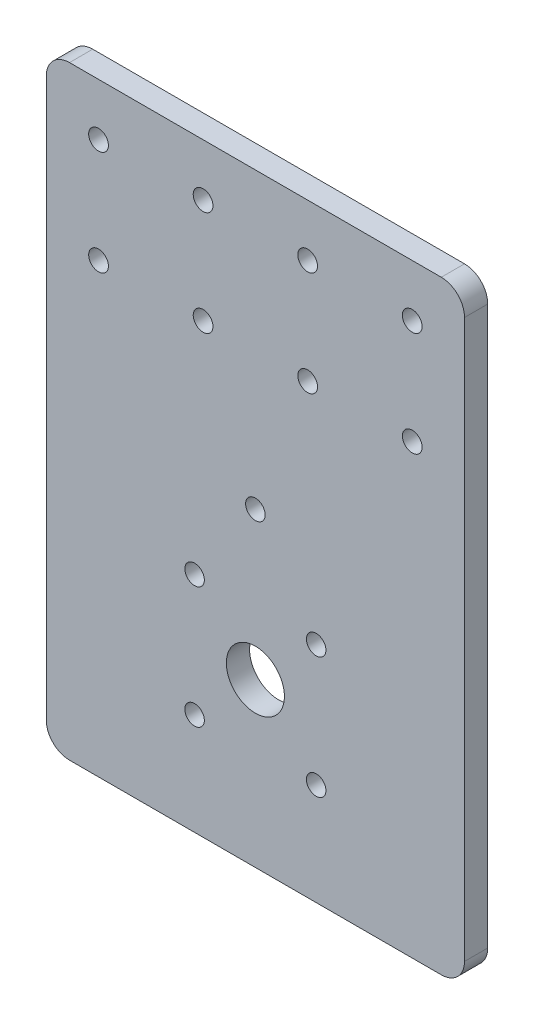
ISO-10303-21;
HEADER;
FILE_DESCRIPTION(('STEP AP214'),'2;1');
FILE_NAME('part.step','',(''),(''),'','','');
FILE_SCHEMA(('AUTOMOTIVE_DESIGN { 1 0 10303 214 1 1 1 1 }'));
ENDSEC;
DATA;
#1=APPLICATION_CONTEXT('core data for automotive mechanical design processes');
#2=APPLICATION_PROTOCOL_DEFINITION('international standard','automotive_design',2000,#1);
#3=PRODUCT_CONTEXT('',#1,'mechanical');
#4=PRODUCT('Part','Part','',(#3));
#5=PRODUCT_RELATED_PRODUCT_CATEGORY('part','',(#4));
#6=PRODUCT_DEFINITION_FORMATION('','',#4);
#7=PRODUCT_DEFINITION_CONTEXT('part definition',#1,'design');
#8=PRODUCT_DEFINITION('design','',#6,#7);
#9=PRODUCT_DEFINITION_SHAPE('','',#8);
#10=(LENGTH_UNIT() NAMED_UNIT(*) SI_UNIT(.MILLI.,.METRE.));
#11=(NAMED_UNIT(*) PLANE_ANGLE_UNIT() SI_UNIT($,.RADIAN.));
#12=(NAMED_UNIT(*) SI_UNIT($,.STERADIAN.) SOLID_ANGLE_UNIT());
#13=UNCERTAINTY_MEASURE_WITH_UNIT(LENGTH_MEASURE(1.E-05),#10,'distance_accuracy_value','');
#14=(GEOMETRIC_REPRESENTATION_CONTEXT(3) GLOBAL_UNCERTAINTY_ASSIGNED_CONTEXT((#13)) GLOBAL_UNIT_ASSIGNED_CONTEXT((#10,
#11,#12)) REPRESENTATION_CONTEXT('',''));
#15=CARTESIAN_POINT('',(0.,0.,0.));
#16=DIRECTION('',(0.,0.,1.));
#17=DIRECTION('',(1.,0.,0.));
#18=AXIS2_PLACEMENT_3D('',#15,#16,#17);
#19=CARTESIAN_POINT('',(80.,-60.,10.));
#20=DIRECTION('',(0.,0.,-1.));
#21=DIRECTION('',(-1.,0.,0.));
#22=AXIS2_PLACEMENT_3D('',#19,#20,#21);
#23=PLANE('',#22);
#24=CARTESIAN_POINT('',(80.,-60.,10.));
#25=DIRECTION('',(0.,0.,1.));
#26=DIRECTION('',(-1.,0.,0.));
#27=AXIS2_PLACEMENT_3D('',#24,#25,#26);
#28=CIRCLE('',#27,9.99999999999999);
#29=CARTESIAN_POINT('',(79.9999999999999,-70.,10.));
#30=VERTEX_POINT('',#29);
#31=CARTESIAN_POINT('',(90.,-59.9999999999999,10.));
#32=VERTEX_POINT('',#31);
#33=EDGE_CURVE('E151',#30,#32,#28,.T.);
#34=ORIENTED_EDGE('',*,*,#33,.T.);
#35=DIRECTION('',(0.,1.,0.));
#36=VECTOR('',#35,1.);
#37=CARTESIAN_POINT('',(90.,-59.9999999999999,10.));
#38=LINE('',#37,#36);
#39=CARTESIAN_POINT('',(90.,180.,10.));
#40=VERTEX_POINT('',#39);
#41=EDGE_CURVE('E99',#32,#40,#38,.T.);
#42=ORIENTED_EDGE('',*,*,#41,.T.);
#43=CARTESIAN_POINT('',(80.,180.,10.));
#44=DIRECTION('',(0.,0.,1.));
#45=DIRECTION('',(-1.,0.,0.));
#46=AXIS2_PLACEMENT_3D('',#43,#44,#45);
#47=CIRCLE('',#46,10.);
#48=CARTESIAN_POINT('',(80.,190.,10.));
#49=VERTEX_POINT('',#48);
#50=EDGE_CURVE('E166',#40,#49,#47,.T.);
#51=ORIENTED_EDGE('',*,*,#50,.T.);
#52=DIRECTION('',(-1.,0.,0.));
#53=VECTOR('',#52,1.);
#54=CARTESIAN_POINT('',(80.,190.,10.));
#55=LINE('',#54,#53);
#56=CARTESIAN_POINT('',(-79.9999999999999,190.,10.));
#57=VERTEX_POINT('',#56);
#58=EDGE_CURVE('E179',#49,#57,#55,.T.);
#59=ORIENTED_EDGE('',*,*,#58,.T.);
#60=CARTESIAN_POINT('',(-80.,180.,10.));
#61=DIRECTION('',(0.,0.,1.));
#62=DIRECTION('',(-1.,0.,0.));
#63=AXIS2_PLACEMENT_3D('',#60,#61,#62);
#64=CIRCLE('',#63,10.);
#65=CARTESIAN_POINT('',(-90.,180.,10.));
#66=VERTEX_POINT('',#65);
#67=EDGE_CURVE('E118',#57,#66,#64,.T.);
#68=ORIENTED_EDGE('',*,*,#67,.T.);
#69=DIRECTION('',(0.,-1.,0.));
#70=VECTOR('',#69,1.);
#71=CARTESIAN_POINT('',(-90.,180.,10.));
#72=LINE('',#71,#70);
#73=CARTESIAN_POINT('',(-90.,-59.9999999999999,10.));
#74=VERTEX_POINT('',#73);
#75=EDGE_CURVE('E112',#66,#74,#72,.T.);
#76=ORIENTED_EDGE('',*,*,#75,.T.);
#77=CARTESIAN_POINT('',(-80.,-60.,10.));
#78=DIRECTION('',(0.,0.,1.));
#79=DIRECTION('',(-1.,0.,0.));
#80=AXIS2_PLACEMENT_3D('',#77,#78,#79);
#81=CIRCLE('',#80,10.);
#82=CARTESIAN_POINT('',(-79.9999999999999,-70.,10.));
#83=VERTEX_POINT('',#82);
#84=EDGE_CURVE('E116',#74,#83,#81,.T.);
#85=ORIENTED_EDGE('',*,*,#84,.T.);
#86=DIRECTION('',(1.,0.,0.));
#87=VECTOR('',#86,1.);
#88=CARTESIAN_POINT('',(-79.9999999999999,-70.,10.));
#89=LINE('',#88,#87);
#90=EDGE_CURVE('E56',#83,#30,#89,.T.);
#91=ORIENTED_EDGE('',*,*,#90,.T.);
#92=EDGE_LOOP('',(#34,#42,#51,#59,#68,#76,#85,#91));
#93=FACE_BOUND('',#92,.T.);
#94=CARTESIAN_POINT('',(26.1629509039022,26.1629509039023,10.));
#95=DIRECTION('',(0.,0.,1.));
#96=DIRECTION('',(1.,0.,0.));
#97=AXIS2_PLACEMENT_3D('',#94,#95,#96);
#98=CIRCLE('',#97,4.20000000000001);
#99=CARTESIAN_POINT('',(30.3629509039022,26.1629509039023,10.));
#100=VERTEX_POINT('',#99);
#101=EDGE_CURVE('E140',#100,#100,#98,.T.);
#102=ORIENTED_EDGE('',*,*,#101,.F.);
#103=EDGE_LOOP('',(#102));
#104=FACE_BOUND('',#103,.T.);
#105=CARTESIAN_POINT('',(0.,63.5,10.));
#106=DIRECTION('',(0.,0.,1.));
#107=DIRECTION('',(1.,0.,0.));
#108=AXIS2_PLACEMENT_3D('',#105,#106,#107);
#109=CIRCLE('',#108,4.2);
#110=CARTESIAN_POINT('',(4.2,63.5,10.));
#111=VERTEX_POINT('',#110);
#112=EDGE_CURVE('E188',#111,#111,#109,.T.);
#113=ORIENTED_EDGE('',*,*,#112,.F.);
#114=EDGE_LOOP('',(#113));
#115=FACE_BOUND('',#114,.T.);
#116=CARTESIAN_POINT('',(26.1629509039022,-26.1629509039023,10.));
#117=DIRECTION('',(0.,0.,1.));
#118=DIRECTION('',(1.,0.,0.));
#119=AXIS2_PLACEMENT_3D('',#116,#117,#118);
#120=CIRCLE('',#119,4.2);
#121=CARTESIAN_POINT('',(30.3629509039022,-26.1629509039023,10.));
#122=VERTEX_POINT('',#121);
#123=EDGE_CURVE('E194',#122,#122,#120,.T.);
#124=ORIENTED_EDGE('',*,*,#123,.F.);
#125=EDGE_LOOP('',(#124));
#126=FACE_BOUND('',#125,.T.);
#127=CARTESIAN_POINT('',(-26.1629509039024,-26.1629509039021,10.));
#128=DIRECTION('',(0.,0.,1.));
#129=DIRECTION('',(1.,0.,0.));
#130=AXIS2_PLACEMENT_3D('',#127,#128,#129);
#131=CIRCLE('',#130,4.2);
#132=CARTESIAN_POINT('',(-21.9629509039024,-26.1629509039021,10.));
#133=VERTEX_POINT('',#132);
#134=EDGE_CURVE('E200',#133,#133,#131,.T.);
#135=ORIENTED_EDGE('',*,*,#134,.F.);
#136=EDGE_LOOP('',(#135));
#137=FACE_BOUND('',#136,.T.);
#138=CARTESIAN_POINT('',(-26.162950903902,26.1629509039025,10.));
#139=DIRECTION('',(0.,0.,1.));
#140=DIRECTION('',(1.,0.,0.));
#141=AXIS2_PLACEMENT_3D('',#138,#139,#140);
#142=CIRCLE('',#141,4.2);
#143=CARTESIAN_POINT('',(-21.962950903902,26.1629509039025,10.));
#144=VERTEX_POINT('',#143);
#145=EDGE_CURVE('E206',#144,#144,#142,.T.);
#146=ORIENTED_EDGE('',*,*,#145,.F.);
#147=EDGE_LOOP('',(#146));
#148=FACE_BOUND('',#147,.T.);
#149=CARTESIAN_POINT('',(-67.5,167.5,10.));
#150=DIRECTION('',(0.,0.,1.));
#151=DIRECTION('',(1.,0.,0.));
#152=AXIS2_PLACEMENT_3D('',#149,#150,#151);
#153=CIRCLE('',#152,4.25000000000001);
#154=CARTESIAN_POINT('',(-63.25,167.5,10.));
#155=VERTEX_POINT('',#154);
#156=EDGE_CURVE('E212',#155,#155,#153,.T.);
#157=ORIENTED_EDGE('',*,*,#156,.F.);
#158=EDGE_LOOP('',(#157));
#159=FACE_BOUND('',#158,.T.);
#160=CARTESIAN_POINT('',(-67.5,122.5,10.));
#161=DIRECTION('',(0.,0.,1.));
#162=DIRECTION('',(1.,0.,0.));
#163=AXIS2_PLACEMENT_3D('',#160,#161,#162);
#164=CIRCLE('',#163,4.25000000000001);
#165=CARTESIAN_POINT('',(-63.25,122.5,10.));
#166=VERTEX_POINT('',#165);
#167=EDGE_CURVE('E218',#166,#166,#164,.T.);
#168=ORIENTED_EDGE('',*,*,#167,.F.);
#169=EDGE_LOOP('',(#168));
#170=FACE_BOUND('',#169,.T.);
#171=CARTESIAN_POINT('',(0.,0.,10.));
#172=DIRECTION('',(0.,0.,1.));
#173=DIRECTION('',(1.,0.,0.));
#174=AXIS2_PLACEMENT_3D('',#171,#172,#173);
#175=CIRCLE('',#174,12.5);
#176=CARTESIAN_POINT('',(12.5,0.,10.));
#177=VERTEX_POINT('',#176);
#178=EDGE_CURVE('E224',#177,#177,#175,.T.);
#179=ORIENTED_EDGE('',*,*,#178,.F.);
#180=EDGE_LOOP('',(#179));
#181=FACE_BOUND('',#180,.T.);
#182=CARTESIAN_POINT('',(-22.5,167.5,10.));
#183=DIRECTION('',(0.,0.,1.));
#184=DIRECTION('',(1.,0.,0.));
#185=AXIS2_PLACEMENT_3D('',#182,#183,#184);
#186=CIRCLE('',#185,4.25000000000001);
#187=CARTESIAN_POINT('',(-18.25,167.5,10.));
#188=VERTEX_POINT('',#187);
#189=EDGE_CURVE('E230',#188,#188,#186,.T.);
#190=ORIENTED_EDGE('',*,*,#189,.F.);
#191=EDGE_LOOP('',(#190));
#192=FACE_BOUND('',#191,.T.);
#193=CARTESIAN_POINT('',(-22.5,122.5,10.));
#194=DIRECTION('',(0.,0.,1.));
#195=DIRECTION('',(1.,0.,0.));
#196=AXIS2_PLACEMENT_3D('',#193,#194,#195);
#197=CIRCLE('',#196,4.25000000000001);
#198=CARTESIAN_POINT('',(-18.25,122.5,10.));
#199=VERTEX_POINT('',#198);
#200=EDGE_CURVE('E236',#199,#199,#197,.T.);
#201=ORIENTED_EDGE('',*,*,#200,.F.);
#202=EDGE_LOOP('',(#201));
#203=FACE_BOUND('',#202,.T.);
#204=CARTESIAN_POINT('',(22.5,167.5,10.));
#205=DIRECTION('',(0.,0.,1.));
#206=DIRECTION('',(1.,0.,0.));
#207=AXIS2_PLACEMENT_3D('',#204,#205,#206);
#208=CIRCLE('',#207,4.25000000000001);
#209=CARTESIAN_POINT('',(26.75,167.5,10.));
#210=VERTEX_POINT('',#209);
#211=EDGE_CURVE('E242',#210,#210,#208,.T.);
#212=ORIENTED_EDGE('',*,*,#211,.F.);
#213=EDGE_LOOP('',(#212));
#214=FACE_BOUND('',#213,.T.);
#215=CARTESIAN_POINT('',(22.5,122.5,10.));
#216=DIRECTION('',(0.,0.,1.));
#217=DIRECTION('',(1.,0.,0.));
#218=AXIS2_PLACEMENT_3D('',#215,#216,#217);
#219=CIRCLE('',#218,4.25000000000001);
#220=CARTESIAN_POINT('',(26.75,122.5,10.));
#221=VERTEX_POINT('',#220);
#222=EDGE_CURVE('E248',#221,#221,#219,.T.);
#223=ORIENTED_EDGE('',*,*,#222,.F.);
#224=EDGE_LOOP('',(#223));
#225=FACE_BOUND('',#224,.T.);
#226=CARTESIAN_POINT('',(67.5,167.5,10.));
#227=DIRECTION('',(0.,0.,1.));
#228=DIRECTION('',(1.,0.,0.));
#229=AXIS2_PLACEMENT_3D('',#226,#227,#228);
#230=CIRCLE('',#229,4.25000000000001);
#231=CARTESIAN_POINT('',(71.75,167.5,10.));
#232=VERTEX_POINT('',#231);
#233=EDGE_CURVE('E254',#232,#232,#230,.T.);
#234=ORIENTED_EDGE('',*,*,#233,.F.);
#235=EDGE_LOOP('',(#234));
#236=FACE_BOUND('',#235,.T.);
#237=CARTESIAN_POINT('',(67.5,122.5,10.));
#238=DIRECTION('',(0.,0.,1.));
#239=DIRECTION('',(1.,0.,0.));
#240=AXIS2_PLACEMENT_3D('',#237,#238,#239);
#241=CIRCLE('',#240,4.25000000000001);
#242=CARTESIAN_POINT('',(71.75,122.5,10.));
#243=VERTEX_POINT('',#242);
#244=EDGE_CURVE('E260',#243,#243,#241,.T.);
#245=ORIENTED_EDGE('',*,*,#244,.F.);
#246=EDGE_LOOP('',(#245));
#247=FACE_BOUND('',#246,.T.);
#248=ADVANCED_FACE('F39',(#93,#104,#115,#126,#137,#148,#159,#170,#181,#192,#203,#214,#225,#236,
#247),#23,.F.);
#249=CARTESIAN_POINT('',(80.,-60.,0.));
#250=DIRECTION('',(0.,0.,-1.));
#251=DIRECTION('',(-1.,0.,0.));
#252=AXIS2_PLACEMENT_3D('',#249,#250,#251);
#253=PLANE('',#252);
#254=CARTESIAN_POINT('',(67.5,167.5,0.));
#255=DIRECTION('',(0.,0.,1.));
#256=DIRECTION('',(1.,0.,0.));
#257=AXIS2_PLACEMENT_3D('',#254,#255,#256);
#258=CIRCLE('',#257,4.25000000000001);
#259=CARTESIAN_POINT('',(71.75,167.5,0.));
#260=VERTEX_POINT('',#259);
#261=EDGE_CURVE('E257',#260,#260,#258,.T.);
#262=ORIENTED_EDGE('',*,*,#261,.T.);
#263=EDGE_LOOP('',(#262));
#264=FACE_BOUND('',#263,.T.);
#265=CARTESIAN_POINT('',(22.5,167.5,0.));
#266=DIRECTION('',(0.,0.,1.));
#267=DIRECTION('',(1.,0.,0.));
#268=AXIS2_PLACEMENT_3D('',#265,#266,#267);
#269=CIRCLE('',#268,4.25000000000001);
#270=CARTESIAN_POINT('',(26.75,167.5,0.));
#271=VERTEX_POINT('',#270);
#272=EDGE_CURVE('E245',#271,#271,#269,.T.);
#273=ORIENTED_EDGE('',*,*,#272,.T.);
#274=EDGE_LOOP('',(#273));
#275=FACE_BOUND('',#274,.T.);
#276=CARTESIAN_POINT('',(-22.5,167.5,0.));
#277=DIRECTION('',(0.,0.,1.));
#278=DIRECTION('',(1.,0.,0.));
#279=AXIS2_PLACEMENT_3D('',#276,#277,#278);
#280=CIRCLE('',#279,4.25000000000001);
#281=CARTESIAN_POINT('',(-18.25,167.5,0.));
#282=VERTEX_POINT('',#281);
#283=EDGE_CURVE('E233',#282,#282,#280,.T.);
#284=ORIENTED_EDGE('',*,*,#283,.T.);
#285=EDGE_LOOP('',(#284));
#286=FACE_BOUND('',#285,.T.);
#287=CARTESIAN_POINT('',(-67.5,122.5,0.));
#288=DIRECTION('',(0.,0.,1.));
#289=DIRECTION('',(1.,0.,0.));
#290=AXIS2_PLACEMENT_3D('',#287,#288,#289);
#291=CIRCLE('',#290,4.25000000000001);
#292=CARTESIAN_POINT('',(-63.25,122.5,0.));
#293=VERTEX_POINT('',#292);
#294=EDGE_CURVE('E221',#293,#293,#291,.T.);
#295=ORIENTED_EDGE('',*,*,#294,.T.);
#296=EDGE_LOOP('',(#295));
#297=FACE_BOUND('',#296,.T.);
#298=CARTESIAN_POINT('',(-26.162950903902,26.1629509039025,0.));
#299=DIRECTION('',(0.,0.,1.));
#300=DIRECTION('',(1.,0.,0.));
#301=AXIS2_PLACEMENT_3D('',#298,#299,#300);
#302=CIRCLE('',#301,4.2);
#303=CARTESIAN_POINT('',(-21.962950903902,26.1629509039025,0.));
#304=VERTEX_POINT('',#303);
#305=EDGE_CURVE('E209',#304,#304,#302,.T.);
#306=ORIENTED_EDGE('',*,*,#305,.T.);
#307=EDGE_LOOP('',(#306));
#308=FACE_BOUND('',#307,.T.);
#309=CARTESIAN_POINT('',(26.1629509039022,-26.1629509039023,0.));
#310=DIRECTION('',(0.,0.,1.));
#311=DIRECTION('',(1.,0.,0.));
#312=AXIS2_PLACEMENT_3D('',#309,#310,#311);
#313=CIRCLE('',#312,4.2);
#314=CARTESIAN_POINT('',(30.3629509039022,-26.1629509039023,0.));
#315=VERTEX_POINT('',#314);
#316=EDGE_CURVE('E197',#315,#315,#313,.T.);
#317=ORIENTED_EDGE('',*,*,#316,.T.);
#318=EDGE_LOOP('',(#317));
#319=FACE_BOUND('',#318,.T.);
#320=CARTESIAN_POINT('',(26.1629509039022,26.1629509039023,0.));
#321=DIRECTION('',(0.,0.,1.));
#322=DIRECTION('',(1.,0.,0.));
#323=AXIS2_PLACEMENT_3D('',#320,#321,#322);
#324=CIRCLE('',#323,4.20000000000001);
#325=CARTESIAN_POINT('',(30.3629509039022,26.1629509039023,0.));
#326=VERTEX_POINT('',#325);
#327=EDGE_CURVE('E185',#326,#326,#324,.T.);
#328=ORIENTED_EDGE('',*,*,#327,.T.);
#329=EDGE_LOOP('',(#328));
#330=FACE_BOUND('',#329,.T.);
#331=CARTESIAN_POINT('',(80.,-60.,0.));
#332=DIRECTION('',(0.,0.,1.));
#333=DIRECTION('',(-1.,0.,0.));
#334=AXIS2_PLACEMENT_3D('',#331,#332,#333);
#335=CIRCLE('',#334,9.99999999999999);
#336=CARTESIAN_POINT('',(79.9999999999999,-70.,0.));
#337=VERTEX_POINT('',#336);
#338=CARTESIAN_POINT('',(90.,-59.9999999999999,0.));
#339=VERTEX_POINT('',#338);
#340=EDGE_CURVE('E136',#337,#339,#335,.T.);
#341=ORIENTED_EDGE('',*,*,#340,.F.);
#342=DIRECTION('',(1.,0.,0.));
#343=VECTOR('',#342,1.);
#344=CARTESIAN_POINT('',(-79.9999999999999,-70.,0.));
#345=LINE('',#344,#343);
#346=CARTESIAN_POINT('',(-79.9999999999999,-70.,0.));
#347=VERTEX_POINT('',#346);
#348=EDGE_CURVE('E91',#347,#337,#345,.T.);
#349=ORIENTED_EDGE('',*,*,#348,.F.);
#350=CARTESIAN_POINT('',(-80.,-60.,0.));
#351=DIRECTION('',(0.,0.,1.));
#352=DIRECTION('',(-1.,0.,0.));
#353=AXIS2_PLACEMENT_3D('',#350,#351,#352);
#354=CIRCLE('',#353,10.);
#355=CARTESIAN_POINT('',(-90.,-59.9999999999999,0.));
#356=VERTEX_POINT('',#355);
#357=EDGE_CURVE('E85',#356,#347,#354,.T.);
#358=ORIENTED_EDGE('',*,*,#357,.F.);
#359=DIRECTION('',(0.,-1.,0.));
#360=VECTOR('',#359,1.);
#361=CARTESIAN_POINT('',(-90.,180.,0.));
#362=LINE('',#361,#360);
#363=CARTESIAN_POINT('',(-90.,180.,0.));
#364=VERTEX_POINT('',#363);
#365=EDGE_CURVE('E126',#364,#356,#362,.T.);
#366=ORIENTED_EDGE('',*,*,#365,.F.);
#367=CARTESIAN_POINT('',(-80.,180.,0.));
#368=DIRECTION('',(0.,0.,1.));
#369=DIRECTION('',(-1.,0.,0.));
#370=AXIS2_PLACEMENT_3D('',#367,#368,#369);
#371=CIRCLE('',#370,10.);
#372=CARTESIAN_POINT('',(-79.9999999999999,190.,0.));
#373=VERTEX_POINT('',#372);
#374=EDGE_CURVE('E146',#373,#364,#371,.T.);
#375=ORIENTED_EDGE('',*,*,#374,.F.);
#376=DIRECTION('',(-1.,0.,0.));
#377=VECTOR('',#376,1.);
#378=CARTESIAN_POINT('',(80.,190.,0.));
#379=LINE('',#378,#377);
#380=CARTESIAN_POINT('',(80.,190.,0.));
#381=VERTEX_POINT('',#380);
#382=EDGE_CURVE('E144',#381,#373,#379,.T.);
#383=ORIENTED_EDGE('',*,*,#382,.F.);
#384=CARTESIAN_POINT('',(80.,180.,0.));
#385=DIRECTION('',(0.,0.,1.));
#386=DIRECTION('',(-1.,0.,0.));
#387=AXIS2_PLACEMENT_3D('',#384,#385,#386);
#388=CIRCLE('',#387,10.);
#389=CARTESIAN_POINT('',(90.,180.,0.));
#390=VERTEX_POINT('',#389);
#391=EDGE_CURVE('E142',#390,#381,#388,.T.);
#392=ORIENTED_EDGE('',*,*,#391,.F.);
#393=DIRECTION('',(0.,1.,0.));
#394=VECTOR('',#393,1.);
#395=CARTESIAN_POINT('',(90.,-59.9999999999999,0.));
#396=LINE('',#395,#394);
#397=EDGE_CURVE('E139',#339,#390,#396,.T.);
#398=ORIENTED_EDGE('',*,*,#397,.F.);
#399=EDGE_LOOP('',(#341,#349,#358,#366,#375,#383,#392,#398));
#400=FACE_BOUND('',#399,.T.);
#401=CARTESIAN_POINT('',(0.,63.5,0.));
#402=DIRECTION('',(0.,0.,1.));
#403=DIRECTION('',(1.,0.,0.));
#404=AXIS2_PLACEMENT_3D('',#401,#402,#403);
#405=CIRCLE('',#404,4.2);
#406=CARTESIAN_POINT('',(4.2,63.5,0.));
#407=VERTEX_POINT('',#406);
#408=EDGE_CURVE('E191',#407,#407,#405,.T.);
#409=ORIENTED_EDGE('',*,*,#408,.T.);
#410=EDGE_LOOP('',(#409));
#411=FACE_BOUND('',#410,.T.);
#412=CARTESIAN_POINT('',(-26.1629509039024,-26.1629509039021,0.));
#413=DIRECTION('',(0.,0.,1.));
#414=DIRECTION('',(1.,0.,0.));
#415=AXIS2_PLACEMENT_3D('',#412,#413,#414);
#416=CIRCLE('',#415,4.2);
#417=CARTESIAN_POINT('',(-21.9629509039024,-26.1629509039021,0.));
#418=VERTEX_POINT('',#417);
#419=EDGE_CURVE('E203',#418,#418,#416,.T.);
#420=ORIENTED_EDGE('',*,*,#419,.T.);
#421=EDGE_LOOP('',(#420));
#422=FACE_BOUND('',#421,.T.);
#423=CARTESIAN_POINT('',(-67.5,167.5,0.));
#424=DIRECTION('',(0.,0.,1.));
#425=DIRECTION('',(1.,0.,0.));
#426=AXIS2_PLACEMENT_3D('',#423,#424,#425);
#427=CIRCLE('',#426,4.25000000000001);
#428=CARTESIAN_POINT('',(-63.25,167.5,0.));
#429=VERTEX_POINT('',#428);
#430=EDGE_CURVE('E215',#429,#429,#427,.T.);
#431=ORIENTED_EDGE('',*,*,#430,.T.);
#432=EDGE_LOOP('',(#431));
#433=FACE_BOUND('',#432,.T.);
#434=CARTESIAN_POINT('',(0.,0.,0.));
#435=DIRECTION('',(0.,0.,1.));
#436=DIRECTION('',(1.,0.,0.));
#437=AXIS2_PLACEMENT_3D('',#434,#435,#436);
#438=CIRCLE('',#437,12.5);
#439=CARTESIAN_POINT('',(12.5,0.,0.));
#440=VERTEX_POINT('',#439);
#441=EDGE_CURVE('E227',#440,#440,#438,.T.);
#442=ORIENTED_EDGE('',*,*,#441,.T.);
#443=EDGE_LOOP('',(#442));
#444=FACE_BOUND('',#443,.T.);
#445=CARTESIAN_POINT('',(-22.5,122.5,0.));
#446=DIRECTION('',(0.,0.,1.));
#447=DIRECTION('',(1.,0.,0.));
#448=AXIS2_PLACEMENT_3D('',#445,#446,#447);
#449=CIRCLE('',#448,4.25000000000001);
#450=CARTESIAN_POINT('',(-18.25,122.5,0.));
#451=VERTEX_POINT('',#450);
#452=EDGE_CURVE('E239',#451,#451,#449,.T.);
#453=ORIENTED_EDGE('',*,*,#452,.T.);
#454=EDGE_LOOP('',(#453));
#455=FACE_BOUND('',#454,.T.);
#456=CARTESIAN_POINT('',(22.5,122.5,0.));
#457=DIRECTION('',(0.,0.,1.));
#458=DIRECTION('',(1.,0.,0.));
#459=AXIS2_PLACEMENT_3D('',#456,#457,#458);
#460=CIRCLE('',#459,4.25000000000001);
#461=CARTESIAN_POINT('',(26.75,122.5,0.));
#462=VERTEX_POINT('',#461);
#463=EDGE_CURVE('E251',#462,#462,#460,.T.);
#464=ORIENTED_EDGE('',*,*,#463,.T.);
#465=EDGE_LOOP('',(#464));
#466=FACE_BOUND('',#465,.T.);
#467=CARTESIAN_POINT('',(67.5,122.5,0.));
#468=DIRECTION('',(0.,0.,1.));
#469=DIRECTION('',(1.,0.,0.));
#470=AXIS2_PLACEMENT_3D('',#467,#468,#469);
#471=CIRCLE('',#470,4.25000000000001);
#472=CARTESIAN_POINT('',(71.75,122.5,0.));
#473=VERTEX_POINT('',#472);
#474=EDGE_CURVE('E263',#473,#473,#471,.T.);
#475=ORIENTED_EDGE('',*,*,#474,.T.);
#476=EDGE_LOOP('',(#475));
#477=FACE_BOUND('',#476,.T.);
#478=ADVANCED_FACE('F170',(#264,#275,#286,#297,#308,#319,#330,#400,#411,#422,#433,#444,#455,
#466,#477),#253,.T.);
#479=CARTESIAN_POINT('',(80.,-60.,10.));
#480=DIRECTION('',(0.,0.,-1.));
#481=DIRECTION('',(-1.,0.,0.));
#482=AXIS2_PLACEMENT_3D('',#479,#480,#481);
#483=CYLINDRICAL_SURFACE('',#482,9.99999999999999);
#484=ORIENTED_EDGE('',*,*,#340,.T.);
#485=DIRECTION('',(0.,0.,-1.));
#486=VECTOR('',#485,1.);
#487=CARTESIAN_POINT('',(90.,-59.9999999999999,10.));
#488=LINE('',#487,#486);
#489=EDGE_CURVE('E11',#32,#339,#488,.T.);
#490=ORIENTED_EDGE('',*,*,#489,.F.);
#491=ORIENTED_EDGE('',*,*,#33,.F.);
#492=DIRECTION('',(0.,0.,-1.));
#493=VECTOR('',#492,1.);
#494=CARTESIAN_POINT('',(79.9999999999999,-70.,10.));
#495=LINE('',#494,#493);
#496=EDGE_CURVE('E132',#30,#337,#495,.T.);
#497=ORIENTED_EDGE('',*,*,#496,.T.);
#498=EDGE_LOOP('',(#484,#490,#491,#497));
#499=FACE_BOUND('',#498,.T.);
#500=ADVANCED_FACE('F41',(#499),#483,.T.);
#501=CARTESIAN_POINT('',(90.,-59.9999999999999,10.));
#502=DIRECTION('',(-1.,0.,0.));
#503=DIRECTION('',(0.,-1.,0.));
#504=AXIS2_PLACEMENT_3D('',#501,#502,#503);
#505=PLANE('',#504);
#506=ORIENTED_EDGE('',*,*,#397,.T.);
#507=DIRECTION('',(0.,0.,-1.));
#508=VECTOR('',#507,1.);
#509=CARTESIAN_POINT('',(90.,180.,10.));
#510=LINE('',#509,#508);
#511=EDGE_CURVE('E48',#40,#390,#510,.T.);
#512=ORIENTED_EDGE('',*,*,#511,.F.);
#513=ORIENTED_EDGE('',*,*,#41,.F.);
#514=ORIENTED_EDGE('',*,*,#489,.T.);
#515=EDGE_LOOP('',(#506,#512,#513,#514));
#516=FACE_BOUND('',#515,.T.);
#517=ADVANCED_FACE('F295',(#516),#505,.F.);
#518=CARTESIAN_POINT('',(80.,180.,10.));
#519=DIRECTION('',(0.,0.,-1.));
#520=DIRECTION('',(-1.,0.,0.));
#521=AXIS2_PLACEMENT_3D('',#518,#519,#520);
#522=CYLINDRICAL_SURFACE('',#521,10.);
#523=ORIENTED_EDGE('',*,*,#391,.T.);
#524=DIRECTION('',(0.,0.,-1.));
#525=VECTOR('',#524,1.);
#526=CARTESIAN_POINT('',(80.,190.,10.));
#527=LINE('',#526,#525);
#528=EDGE_CURVE('E158',#49,#381,#527,.T.);
#529=ORIENTED_EDGE('',*,*,#528,.F.);
#530=ORIENTED_EDGE('',*,*,#50,.F.);
#531=ORIENTED_EDGE('',*,*,#511,.T.);
#532=EDGE_LOOP('',(#523,#529,#530,#531));
#533=FACE_BOUND('',#532,.T.);
#534=ADVANCED_FACE('F164',(#533),#522,.T.);
#535=CARTESIAN_POINT('',(80.,190.,10.));
#536=DIRECTION('',(0.,-1.,0.));
#537=DIRECTION('',(0.,0.,-1.));
#538=AXIS2_PLACEMENT_3D('',#535,#536,#537);
#539=PLANE('',#538);
#540=ORIENTED_EDGE('',*,*,#382,.T.);
#541=DIRECTION('',(0.,0.,-1.));
#542=VECTOR('',#541,1.);
#543=CARTESIAN_POINT('',(-79.9999999999999,190.,10.));
#544=LINE('',#543,#542);
#545=EDGE_CURVE('E155',#57,#373,#544,.T.);
#546=ORIENTED_EDGE('',*,*,#545,.F.);
#547=ORIENTED_EDGE('',*,*,#58,.F.);
#548=ORIENTED_EDGE('',*,*,#528,.T.);
#549=EDGE_LOOP('',(#540,#546,#547,#548));
#550=FACE_BOUND('',#549,.T.);
#551=ADVANCED_FACE('F175',(#550),#539,.F.);
#552=CARTESIAN_POINT('',(-80.,180.,10.));
#553=DIRECTION('',(0.,0.,-1.));
#554=DIRECTION('',(-1.,0.,0.));
#555=AXIS2_PLACEMENT_3D('',#552,#553,#554);
#556=CYLINDRICAL_SURFACE('',#555,10.);
#557=ORIENTED_EDGE('',*,*,#374,.T.);
#558=DIRECTION('',(0.,0.,-1.));
#559=VECTOR('',#558,1.);
#560=CARTESIAN_POINT('',(-90.,180.,10.));
#561=LINE('',#560,#559);
#562=EDGE_CURVE('E127',#66,#364,#561,.T.);
#563=ORIENTED_EDGE('',*,*,#562,.F.);
#564=ORIENTED_EDGE('',*,*,#67,.F.);
#565=ORIENTED_EDGE('',*,*,#545,.T.);
#566=EDGE_LOOP('',(#557,#563,#564,#565));
#567=FACE_BOUND('',#566,.T.);
#568=ADVANCED_FACE('F178',(#567),#556,.T.);
#569=CARTESIAN_POINT('',(-90.,180.,10.));
#570=DIRECTION('',(1.,0.,0.));
#571=DIRECTION('',(0.,0.,-1.));
#572=AXIS2_PLACEMENT_3D('',#569,#570,#571);
#573=PLANE('',#572);
#574=ORIENTED_EDGE('',*,*,#365,.T.);
#575=DIRECTION('',(0.,0.,-1.));
#576=VECTOR('',#575,1.);
#577=CARTESIAN_POINT('',(-90.,-59.9999999999999,10.));
#578=LINE('',#577,#576);
#579=EDGE_CURVE('E123',#74,#356,#578,.T.);
#580=ORIENTED_EDGE('',*,*,#579,.F.);
#581=ORIENTED_EDGE('',*,*,#75,.F.);
#582=ORIENTED_EDGE('',*,*,#562,.T.);
#583=EDGE_LOOP('',(#574,#580,#581,#582));
#584=FACE_BOUND('',#583,.T.);
#585=ADVANCED_FACE('F124',(#584),#573,.F.);
#586=CARTESIAN_POINT('',(-80.,-60.,10.));
#587=DIRECTION('',(0.,0.,-1.));
#588=DIRECTION('',(-1.,0.,0.));
#589=AXIS2_PLACEMENT_3D('',#586,#587,#588);
#590=CYLINDRICAL_SURFACE('',#589,10.);
#591=ORIENTED_EDGE('',*,*,#357,.T.);
#592=DIRECTION('',(0.,0.,-1.));
#593=VECTOR('',#592,1.);
#594=CARTESIAN_POINT('',(-79.9999999999999,-70.,10.));
#595=LINE('',#594,#593);
#596=EDGE_CURVE('E128',#83,#347,#595,.T.);
#597=ORIENTED_EDGE('',*,*,#596,.F.);
#598=ORIENTED_EDGE('',*,*,#84,.F.);
#599=ORIENTED_EDGE('',*,*,#579,.T.);
#600=EDGE_LOOP('',(#591,#597,#598,#599));
#601=FACE_BOUND('',#600,.T.);
#602=ADVANCED_FACE('F130',(#601),#590,.T.);
#603=CARTESIAN_POINT('',(-79.9999999999999,-70.,10.));
#604=DIRECTION('',(0.,1.,0.));
#605=DIRECTION('',(-1.,0.,0.));
#606=AXIS2_PLACEMENT_3D('',#603,#604,#605);
#607=PLANE('',#606);
#608=ORIENTED_EDGE('',*,*,#348,.T.);
#609=ORIENTED_EDGE('',*,*,#496,.F.);
#610=ORIENTED_EDGE('',*,*,#90,.F.);
#611=ORIENTED_EDGE('',*,*,#596,.T.);
#612=EDGE_LOOP('',(#608,#609,#610,#611));
#613=FACE_BOUND('',#612,.T.);
#614=ADVANCED_FACE('F283',(#613),#607,.F.);
#615=CARTESIAN_POINT('',(26.1629509039022,26.1629509039023,10.));
#616=DIRECTION('',(0.,0.,-1.));
#617=DIRECTION('',(-1.,0.,0.));
#618=AXIS2_PLACEMENT_3D('',#615,#616,#617);
#619=CYLINDRICAL_SURFACE('',#618,4.20000000000001);
#620=ORIENTED_EDGE('',*,*,#101,.T.);
#621=EDGE_LOOP('',(#620));
#622=FACE_BOUND('',#621,.T.);
#623=ORIENTED_EDGE('',*,*,#327,.F.);
#624=EDGE_LOOP('',(#623));
#625=FACE_BOUND('',#624,.T.);
#626=ADVANCED_FACE('F280',(#622,#625),#619,.F.);
#627=CARTESIAN_POINT('',(0.,63.5,10.));
#628=DIRECTION('',(0.,0.,-1.));
#629=DIRECTION('',(-1.,0.,0.));
#630=AXIS2_PLACEMENT_3D('',#627,#628,#629);
#631=CYLINDRICAL_SURFACE('',#630,4.2);
#632=ORIENTED_EDGE('',*,*,#112,.T.);
#633=EDGE_LOOP('',(#632));
#634=FACE_BOUND('',#633,.T.);
#635=ORIENTED_EDGE('',*,*,#408,.F.);
#636=EDGE_LOOP('',(#635));
#637=FACE_BOUND('',#636,.T.);
#638=ADVANCED_FACE('F358',(#634,#637),#631,.F.);
#639=CARTESIAN_POINT('',(26.1629509039022,-26.1629509039023,10.));
#640=DIRECTION('',(0.,0.,-1.));
#641=DIRECTION('',(-1.,0.,0.));
#642=AXIS2_PLACEMENT_3D('',#639,#640,#641);
#643=CYLINDRICAL_SURFACE('',#642,4.2);
#644=ORIENTED_EDGE('',*,*,#123,.T.);
#645=EDGE_LOOP('',(#644));
#646=FACE_BOUND('',#645,.T.);
#647=ORIENTED_EDGE('',*,*,#316,.F.);
#648=EDGE_LOOP('',(#647));
#649=FACE_BOUND('',#648,.T.);
#650=ADVANCED_FACE('F366',(#646,#649),#643,.F.);
#651=CARTESIAN_POINT('',(-26.1629509039024,-26.1629509039021,10.));
#652=DIRECTION('',(0.,0.,-1.));
#653=DIRECTION('',(-1.,0.,0.));
#654=AXIS2_PLACEMENT_3D('',#651,#652,#653);
#655=CYLINDRICAL_SURFACE('',#654,4.2);
#656=ORIENTED_EDGE('',*,*,#134,.T.);
#657=EDGE_LOOP('',(#656));
#658=FACE_BOUND('',#657,.T.);
#659=ORIENTED_EDGE('',*,*,#419,.F.);
#660=EDGE_LOOP('',(#659));
#661=FACE_BOUND('',#660,.T.);
#662=ADVANCED_FACE('F374',(#658,#661),#655,.F.);
#663=CARTESIAN_POINT('',(-26.162950903902,26.1629509039025,10.));
#664=DIRECTION('',(0.,0.,-1.));
#665=DIRECTION('',(-1.,0.,0.));
#666=AXIS2_PLACEMENT_3D('',#663,#664,#665);
#667=CYLINDRICAL_SURFACE('',#666,4.2);
#668=ORIENTED_EDGE('',*,*,#145,.T.);
#669=EDGE_LOOP('',(#668));
#670=FACE_BOUND('',#669,.T.);
#671=ORIENTED_EDGE('',*,*,#305,.F.);
#672=EDGE_LOOP('',(#671));
#673=FACE_BOUND('',#672,.T.);
#674=ADVANCED_FACE('F383',(#670,#673),#667,.F.);
#675=CARTESIAN_POINT('',(-67.5,167.5,10.));
#676=DIRECTION('',(0.,0.,-1.));
#677=DIRECTION('',(-1.,0.,0.));
#678=AXIS2_PLACEMENT_3D('',#675,#676,#677);
#679=CYLINDRICAL_SURFACE('',#678,4.25000000000001);
#680=ORIENTED_EDGE('',*,*,#156,.T.);
#681=EDGE_LOOP('',(#680));
#682=FACE_BOUND('',#681,.T.);
#683=ORIENTED_EDGE('',*,*,#430,.F.);
#684=EDGE_LOOP('',(#683));
#685=FACE_BOUND('',#684,.T.);
#686=ADVANCED_FACE('F392',(#682,#685),#679,.F.);
#687=CARTESIAN_POINT('',(-67.5,122.5,10.));
#688=DIRECTION('',(0.,0.,-1.));
#689=DIRECTION('',(-1.,0.,0.));
#690=AXIS2_PLACEMENT_3D('',#687,#688,#689);
#691=CYLINDRICAL_SURFACE('',#690,4.25000000000001);
#692=ORIENTED_EDGE('',*,*,#167,.T.);
#693=EDGE_LOOP('',(#692));
#694=FACE_BOUND('',#693,.T.);
#695=ORIENTED_EDGE('',*,*,#294,.F.);
#696=EDGE_LOOP('',(#695));
#697=FACE_BOUND('',#696,.T.);
#698=ADVANCED_FACE('F401',(#694,#697),#691,.F.);
#699=CARTESIAN_POINT('',(0.,0.,10.));
#700=DIRECTION('',(0.,0.,-1.));
#701=DIRECTION('',(-1.,0.,0.));
#702=AXIS2_PLACEMENT_3D('',#699,#700,#701);
#703=CYLINDRICAL_SURFACE('',#702,12.5);
#704=ORIENTED_EDGE('',*,*,#178,.T.);
#705=EDGE_LOOP('',(#704));
#706=FACE_BOUND('',#705,.T.);
#707=ORIENTED_EDGE('',*,*,#441,.F.);
#708=EDGE_LOOP('',(#707));
#709=FACE_BOUND('',#708,.T.);
#710=ADVANCED_FACE('F410',(#706,#709),#703,.F.);
#711=CARTESIAN_POINT('',(-22.5,167.5,10.));
#712=DIRECTION('',(0.,0.,-1.));
#713=DIRECTION('',(-1.,0.,0.));
#714=AXIS2_PLACEMENT_3D('',#711,#712,#713);
#715=CYLINDRICAL_SURFACE('',#714,4.25000000000001);
#716=ORIENTED_EDGE('',*,*,#189,.T.);
#717=EDGE_LOOP('',(#716));
#718=FACE_BOUND('',#717,.T.);
#719=ORIENTED_EDGE('',*,*,#283,.F.);
#720=EDGE_LOOP('',(#719));
#721=FACE_BOUND('',#720,.T.);
#722=ADVANCED_FACE('F419',(#718,#721),#715,.F.);
#723=CARTESIAN_POINT('',(-22.5,122.5,10.));
#724=DIRECTION('',(0.,0.,-1.));
#725=DIRECTION('',(-1.,0.,0.));
#726=AXIS2_PLACEMENT_3D('',#723,#724,#725);
#727=CYLINDRICAL_SURFACE('',#726,4.25000000000001);
#728=ORIENTED_EDGE('',*,*,#200,.T.);
#729=EDGE_LOOP('',(#728));
#730=FACE_BOUND('',#729,.T.);
#731=ORIENTED_EDGE('',*,*,#452,.F.);
#732=EDGE_LOOP('',(#731));
#733=FACE_BOUND('',#732,.T.);
#734=ADVANCED_FACE('F428',(#730,#733),#727,.F.);
#735=CARTESIAN_POINT('',(22.5,167.5,10.));
#736=DIRECTION('',(0.,0.,-1.));
#737=DIRECTION('',(-1.,0.,0.));
#738=AXIS2_PLACEMENT_3D('',#735,#736,#737);
#739=CYLINDRICAL_SURFACE('',#738,4.25000000000001);
#740=ORIENTED_EDGE('',*,*,#211,.T.);
#741=EDGE_LOOP('',(#740));
#742=FACE_BOUND('',#741,.T.);
#743=ORIENTED_EDGE('',*,*,#272,.F.);
#744=EDGE_LOOP('',(#743));
#745=FACE_BOUND('',#744,.T.);
#746=ADVANCED_FACE('F437',(#742,#745),#739,.F.);
#747=CARTESIAN_POINT('',(22.5,122.5,10.));
#748=DIRECTION('',(0.,0.,-1.));
#749=DIRECTION('',(-1.,0.,0.));
#750=AXIS2_PLACEMENT_3D('',#747,#748,#749);
#751=CYLINDRICAL_SURFACE('',#750,4.25000000000001);
#752=ORIENTED_EDGE('',*,*,#222,.T.);
#753=EDGE_LOOP('',(#752));
#754=FACE_BOUND('',#753,.T.);
#755=ORIENTED_EDGE('',*,*,#463,.F.);
#756=EDGE_LOOP('',(#755));
#757=FACE_BOUND('',#756,.T.);
#758=ADVANCED_FACE('F446',(#754,#757),#751,.F.);
#759=CARTESIAN_POINT('',(67.5,167.5,10.));
#760=DIRECTION('',(0.,0.,-1.));
#761=DIRECTION('',(-1.,0.,0.));
#762=AXIS2_PLACEMENT_3D('',#759,#760,#761);
#763=CYLINDRICAL_SURFACE('',#762,4.25000000000001);
#764=ORIENTED_EDGE('',*,*,#233,.T.);
#765=EDGE_LOOP('',(#764));
#766=FACE_BOUND('',#765,.T.);
#767=ORIENTED_EDGE('',*,*,#261,.F.);
#768=EDGE_LOOP('',(#767));
#769=FACE_BOUND('',#768,.T.);
#770=ADVANCED_FACE('F455',(#766,#769),#763,.F.);
#771=CARTESIAN_POINT('',(67.5,122.5,10.));
#772=DIRECTION('',(0.,0.,-1.));
#773=DIRECTION('',(-1.,0.,0.));
#774=AXIS2_PLACEMENT_3D('',#771,#772,#773);
#775=CYLINDRICAL_SURFACE('',#774,4.25000000000001);
#776=ORIENTED_EDGE('',*,*,#244,.T.);
#777=EDGE_LOOP('',(#776));
#778=FACE_BOUND('',#777,.T.);
#779=ORIENTED_EDGE('',*,*,#474,.F.);
#780=EDGE_LOOP('',(#779));
#781=FACE_BOUND('',#780,.T.);
#782=ADVANCED_FACE('F269',(#778,#781),#775,.F.);
#783=CLOSED_SHELL('',(#248,#478,#500,#517,#534,#551,#568,#585,#602,#614,#626,#638,#650,#662,
#674,#686,#698,#710,#722,#734,#746,#758,#770,#782));
#784=MANIFOLD_SOLID_BREP('B2',#783);
#785=ADVANCED_BREP_SHAPE_REPRESENTATION('',(#18,#784),#14);
#786=SHAPE_DEFINITION_REPRESENTATION(#9,#785);
ENDSEC;
END-ISO-10303-21;
